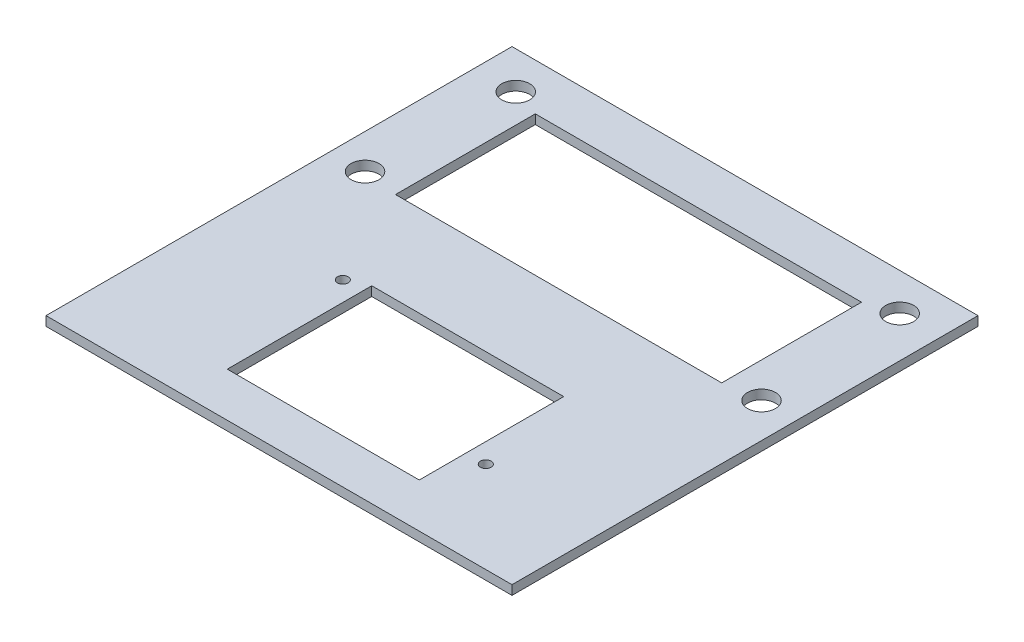
ISO-10303-21;
HEADER;
FILE_DESCRIPTION(('STEP AP214'),'2;1');
FILE_NAME('part.step','',(''),(''),'','','');
FILE_SCHEMA(('AUTOMOTIVE_DESIGN { 1 0 10303 214 1 1 1 1 }'));
ENDSEC;
DATA;
#1=APPLICATION_CONTEXT('core data for automotive mechanical design processes');
#2=APPLICATION_PROTOCOL_DEFINITION('international standard','automotive_design',2000,#1);
#3=PRODUCT_CONTEXT('',#1,'mechanical');
#4=PRODUCT('Part','Part','',(#3));
#5=PRODUCT_RELATED_PRODUCT_CATEGORY('part','',(#4));
#6=PRODUCT_DEFINITION_FORMATION('','',#4);
#7=PRODUCT_DEFINITION_CONTEXT('part definition',#1,'design');
#8=PRODUCT_DEFINITION('design','',#6,#7);
#9=PRODUCT_DEFINITION_SHAPE('','',#8);
#10=(LENGTH_UNIT() NAMED_UNIT(*) SI_UNIT(.MILLI.,.METRE.));
#11=(NAMED_UNIT(*) PLANE_ANGLE_UNIT() SI_UNIT($,.RADIAN.));
#12=(NAMED_UNIT(*) SI_UNIT($,.STERADIAN.) SOLID_ANGLE_UNIT());
#13=UNCERTAINTY_MEASURE_WITH_UNIT(LENGTH_MEASURE(1.E-05),#10,'distance_accuracy_value','');
#14=(GEOMETRIC_REPRESENTATION_CONTEXT(3) GLOBAL_UNCERTAINTY_ASSIGNED_CONTEXT((#13)) GLOBAL_UNIT_ASSIGNED_CONTEXT((#10,
#11,#12)) REPRESENTATION_CONTEXT('',''));
#15=CARTESIAN_POINT('',(0.,0.,0.));
#16=DIRECTION('',(0.,0.,1.));
#17=DIRECTION('',(1.,0.,0.));
#18=AXIS2_PLACEMENT_3D('',#15,#16,#17);
#19=CARTESIAN_POINT('',(0.,1.27,0.));
#20=DIRECTION('',(0.,1.,0.));
#21=DIRECTION('',(0.,0.,1.));
#22=AXIS2_PLACEMENT_3D('',#19,#20,#21);
#23=PLANE('',#22);
#24=CARTESIAN_POINT('',(-15.748,1.27,7.3025));
#25=DIRECTION('',(0.,-1.,0.));
#26=DIRECTION('',(0.,0.,-1.));
#27=AXIS2_PLACEMENT_3D('',#24,#25,#26);
#28=CIRCLE('',#27,0.730249999999999);
#29=CARTESIAN_POINT('',(-15.748,1.27,6.57225));
#30=VERTEX_POINT('',#29);
#31=EDGE_CURVE('E343',#30,#30,#28,.T.);
#32=ORIENTED_EDGE('',*,*,#31,.T.);
#33=EDGE_LOOP('',(#32));
#34=FACE_BOUND('',#33,.T.);
#35=CARTESIAN_POINT('',(15.748,1.27,19.3167));
#36=DIRECTION('',(0.,-1.,0.));
#37=DIRECTION('',(0.,0.,-1.));
#38=AXIS2_PLACEMENT_3D('',#35,#36,#37);
#39=CIRCLE('',#38,0.730250000000003);
#40=CARTESIAN_POINT('',(15.748,1.27,18.58645));
#41=VERTEX_POINT('',#40);
#42=EDGE_CURVE('E348',#41,#41,#39,.T.);
#43=ORIENTED_EDGE('',*,*,#42,.T.);
#44=EDGE_LOOP('',(#43));
#45=FACE_BOUND('',#44,.T.);
#46=DIRECTION('',(0.,0.,1.));
#47=VECTOR('',#46,1.);
#48=CARTESIAN_POINT('',(-13.081,1.27,25.7175));
#49=LINE('',#48,#47);
#50=CARTESIAN_POINT('',(-13.081,1.27,6.0325));
#51=VERTEX_POINT('',#50);
#52=CARTESIAN_POINT('',(-13.081,1.27,25.7175));
#53=VERTEX_POINT('',#52);
#54=EDGE_CURVE('E48',#51,#53,#49,.T.);
#55=ORIENTED_EDGE('',*,*,#54,.F.);
#56=DIRECTION('',(-1.,0.,0.));
#57=VECTOR('',#56,1.);
#58=CARTESIAN_POINT('',(13.081,1.27,6.03249999999999));
#59=LINE('',#58,#57);
#60=CARTESIAN_POINT('',(13.081,1.27,6.03249999999999));
#61=VERTEX_POINT('',#60);
#62=EDGE_CURVE('E130',#61,#51,#59,.T.);
#63=ORIENTED_EDGE('',*,*,#62,.F.);
#64=DIRECTION('',(0.,0.,-1.));
#65=VECTOR('',#64,1.);
#66=CARTESIAN_POINT('',(13.081,1.27,25.7175));
#67=LINE('',#66,#65);
#68=CARTESIAN_POINT('',(13.081,1.27,25.7175));
#69=VERTEX_POINT('',#68);
#70=EDGE_CURVE('E150',#69,#61,#67,.T.);
#71=ORIENTED_EDGE('',*,*,#70,.F.);
#72=DIRECTION('',(1.,0.,0.));
#73=VECTOR('',#72,1.);
#74=CARTESIAN_POINT('',(13.081,1.27,25.7175));
#75=LINE('',#74,#73);
#76=EDGE_CURVE('E144',#53,#69,#75,.T.);
#77=ORIENTED_EDGE('',*,*,#76,.F.);
#78=EDGE_LOOP('',(#55,#63,#71,#77));
#79=FACE_BOUND('',#78,.T.);
#80=DIRECTION('',(0.,0.,1.));
#81=VECTOR('',#80,1.);
#82=CARTESIAN_POINT('',(-22.225,1.27,-6.35));
#83=LINE('',#82,#81);
#84=CARTESIAN_POINT('',(-22.225,1.27,-25.4));
#85=VERTEX_POINT('',#84);
#86=CARTESIAN_POINT('',(-22.225,1.27,-6.35));
#87=VERTEX_POINT('',#86);
#88=EDGE_CURVE('E136',#85,#87,#83,.T.);
#89=ORIENTED_EDGE('',*,*,#88,.F.);
#90=DIRECTION('',(-1.,0.,0.));
#91=VECTOR('',#90,1.);
#92=CARTESIAN_POINT('',(22.225,1.27,-25.4));
#93=LINE('',#92,#91);
#94=CARTESIAN_POINT('',(22.225,1.27,-25.4));
#95=VERTEX_POINT('',#94);
#96=EDGE_CURVE('E163',#95,#85,#93,.T.);
#97=ORIENTED_EDGE('',*,*,#96,.F.);
#98=DIRECTION('',(0.,0.,-1.));
#99=VECTOR('',#98,1.);
#100=CARTESIAN_POINT('',(22.225,1.27,-6.35000000000001));
#101=LINE('',#100,#99);
#102=CARTESIAN_POINT('',(22.225,1.27,-6.35000000000001));
#103=VERTEX_POINT('',#102);
#104=EDGE_CURVE('E177',#103,#95,#101,.T.);
#105=ORIENTED_EDGE('',*,*,#104,.F.);
#106=DIRECTION('',(1.,0.,0.));
#107=VECTOR('',#106,1.);
#108=CARTESIAN_POINT('',(22.225,1.27,-6.35000000000001));
#109=LINE('',#108,#107);
#110=EDGE_CURVE('E174',#87,#103,#109,.T.);
#111=ORIENTED_EDGE('',*,*,#110,.F.);
#112=EDGE_LOOP('',(#89,#97,#105,#111));
#113=FACE_BOUND('',#112,.T.);
#114=CARTESIAN_POINT('',(-26.162,1.27,-26.67));
#115=DIRECTION('',(0.,1.,0.));
#116=DIRECTION('',(0.,0.,1.));
#117=AXIS2_PLACEMENT_3D('',#114,#115,#116);
#118=CIRCLE('',#117,1.905);
#119=CARTESIAN_POINT('',(-26.162,1.27,-24.765));
#120=VERTEX_POINT('',#119);
#121=EDGE_CURVE('E191',#120,#120,#118,.T.);
#122=ORIENTED_EDGE('',*,*,#121,.F.);
#123=EDGE_LOOP('',(#122));
#124=FACE_BOUND('',#123,.T.);
#125=CARTESIAN_POINT('',(-27.0129,1.27,-6.985));
#126=DIRECTION('',(0.,1.,0.));
#127=DIRECTION('',(0.,0.,1.));
#128=AXIS2_PLACEMENT_3D('',#125,#126,#127);
#129=CIRCLE('',#128,1.905);
#130=CARTESIAN_POINT('',(-27.0129,1.27,-5.08));
#131=VERTEX_POINT('',#130);
#132=EDGE_CURVE('E197',#131,#131,#129,.T.);
#133=ORIENTED_EDGE('',*,*,#132,.F.);
#134=EDGE_LOOP('',(#133));
#135=FACE_BOUND('',#134,.T.);
#136=CARTESIAN_POINT('',(27.0129,1.27,-6.98500000000001));
#137=DIRECTION('',(0.,1.,0.));
#138=DIRECTION('',(0.,0.,1.));
#139=AXIS2_PLACEMENT_3D('',#136,#137,#138);
#140=CIRCLE('',#139,1.905);
#141=CARTESIAN_POINT('',(27.0129,1.27,-5.08000000000001));
#142=VERTEX_POINT('',#141);
#143=EDGE_CURVE('E206',#142,#142,#140,.F.);
#144=ORIENTED_EDGE('',*,*,#143,.T.);
#145=EDGE_LOOP('',(#144));
#146=FACE_BOUND('',#145,.T.);
#147=DIRECTION('',(0.,0.,1.));
#148=VECTOR('',#147,1.);
#149=CARTESIAN_POINT('',(-31.75,1.27,31.75));
#150=LINE('',#149,#148);
#151=CARTESIAN_POINT('',(-31.75,1.27,-31.75));
#152=VERTEX_POINT('',#151);
#153=CARTESIAN_POINT('',(-31.75,1.27,31.75));
#154=VERTEX_POINT('',#153);
#155=EDGE_CURVE('E215',#152,#154,#150,.T.);
#156=ORIENTED_EDGE('',*,*,#155,.T.);
#157=DIRECTION('',(1.,0.,0.));
#158=VECTOR('',#157,1.);
#159=CARTESIAN_POINT('',(31.75,1.27,31.75));
#160=LINE('',#159,#158);
#161=CARTESIAN_POINT('',(31.75,1.27,31.75));
#162=VERTEX_POINT('',#161);
#163=EDGE_CURVE('E218',#154,#162,#160,.T.);
#164=ORIENTED_EDGE('',*,*,#163,.T.);
#165=DIRECTION('',(0.,0.,-1.));
#166=VECTOR('',#165,1.);
#167=CARTESIAN_POINT('',(31.75,1.27,31.75));
#168=LINE('',#167,#166);
#169=CARTESIAN_POINT('',(31.75,1.27,-31.75));
#170=VERTEX_POINT('',#169);
#171=EDGE_CURVE('E221',#162,#170,#168,.T.);
#172=ORIENTED_EDGE('',*,*,#171,.T.);
#173=DIRECTION('',(-1.,0.,0.));
#174=VECTOR('',#173,1.);
#175=CARTESIAN_POINT('',(31.75,1.27,-31.75));
#176=LINE('',#175,#174);
#177=EDGE_CURVE('E223',#170,#152,#176,.T.);
#178=ORIENTED_EDGE('',*,*,#177,.T.);
#179=EDGE_LOOP('',(#156,#164,#172,#178));
#180=FACE_BOUND('',#179,.T.);
#181=CARTESIAN_POINT('',(26.162,1.27,-26.67));
#182=DIRECTION('',(0.,1.,0.));
#183=DIRECTION('',(0.,0.,1.));
#184=AXIS2_PLACEMENT_3D('',#181,#182,#183);
#185=CIRCLE('',#184,1.905);
#186=CARTESIAN_POINT('',(26.162,1.27,-24.765));
#187=VERTEX_POINT('',#186);
#188=EDGE_CURVE('E203',#187,#187,#185,.F.);
#189=ORIENTED_EDGE('',*,*,#188,.T.);
#190=EDGE_LOOP('',(#189));
#191=FACE_BOUND('',#190,.T.);
#192=ADVANCED_FACE('F33',(#34,#45,#79,#113,#124,#135,#146,#180,#191),#23,.T.);
#193=CARTESIAN_POINT('',(0.,0.,0.));
#194=DIRECTION('',(0.,1.,0.));
#195=DIRECTION('',(0.,0.,1.));
#196=AXIS2_PLACEMENT_3D('',#193,#194,#195);
#197=PLANE('',#196);
#198=DIRECTION('',(1.,0.,0.));
#199=VECTOR('',#198,1.);
#200=CARTESIAN_POINT('',(13.081,0.,6.03249999999999));
#201=LINE('',#200,#199);
#202=CARTESIAN_POINT('',(-13.081,0.,6.0325));
#203=VERTEX_POINT('',#202);
#204=CARTESIAN_POINT('',(13.081,0.,6.03249999999999));
#205=VERTEX_POINT('',#204);
#206=EDGE_CURVE('E142',#203,#205,#201,.T.);
#207=ORIENTED_EDGE('',*,*,#206,.F.);
#208=DIRECTION('',(0.,0.,-1.));
#209=VECTOR('',#208,1.);
#210=CARTESIAN_POINT('',(-13.081,0.,25.7175));
#211=LINE('',#210,#209);
#212=CARTESIAN_POINT('',(-13.081,0.,25.7175));
#213=VERTEX_POINT('',#212);
#214=EDGE_CURVE('E124',#213,#203,#211,.T.);
#215=ORIENTED_EDGE('',*,*,#214,.F.);
#216=DIRECTION('',(-1.,0.,0.));
#217=VECTOR('',#216,1.);
#218=CARTESIAN_POINT('',(13.081,0.,25.7175));
#219=LINE('',#218,#217);
#220=CARTESIAN_POINT('',(13.081,0.,25.7175));
#221=VERTEX_POINT('',#220);
#222=EDGE_CURVE('E133',#221,#213,#219,.T.);
#223=ORIENTED_EDGE('',*,*,#222,.F.);
#224=DIRECTION('',(0.,0.,1.));
#225=VECTOR('',#224,1.);
#226=CARTESIAN_POINT('',(13.081,0.,25.7175));
#227=LINE('',#226,#225);
#228=EDGE_CURVE('E56',#205,#221,#227,.T.);
#229=ORIENTED_EDGE('',*,*,#228,.F.);
#230=EDGE_LOOP('',(#207,#215,#223,#229));
#231=FACE_BOUND('',#230,.T.);
#232=CARTESIAN_POINT('',(15.748,0.,19.3167));
#233=DIRECTION('',(0.,1.,0.));
#234=DIRECTION('',(0.,0.,1.));
#235=AXIS2_PLACEMENT_3D('',#232,#233,#234);
#236=CIRCLE('',#235,0.730250000000003);
#237=CARTESIAN_POINT('',(15.748,0.,20.04695));
#238=VERTEX_POINT('',#237);
#239=EDGE_CURVE('E351',#238,#238,#236,.T.);
#240=ORIENTED_EDGE('',*,*,#239,.T.);
#241=EDGE_LOOP('',(#240));
#242=FACE_BOUND('',#241,.T.);
#243=CARTESIAN_POINT('',(-15.748,0.,7.3025));
#244=DIRECTION('',(0.,1.,0.));
#245=DIRECTION('',(0.,0.,1.));
#246=AXIS2_PLACEMENT_3D('',#243,#244,#245);
#247=CIRCLE('',#246,0.730249999999999);
#248=CARTESIAN_POINT('',(-15.748,0.,8.03275));
#249=VERTEX_POINT('',#248);
#250=EDGE_CURVE('E346',#249,#249,#247,.T.);
#251=ORIENTED_EDGE('',*,*,#250,.T.);
#252=EDGE_LOOP('',(#251));
#253=FACE_BOUND('',#252,.T.);
#254=DIRECTION('',(-1.,0.,0.));
#255=VECTOR('',#254,1.);
#256=CARTESIAN_POINT('',(22.225,0.,-25.4));
#257=LINE('',#256,#255);
#258=CARTESIAN_POINT('',(22.225,0.,-25.4));
#259=VERTEX_POINT('',#258);
#260=CARTESIAN_POINT('',(-22.225,0.,-25.4));
#261=VERTEX_POINT('',#260);
#262=EDGE_CURVE('E169',#259,#261,#257,.T.);
#263=ORIENTED_EDGE('',*,*,#262,.T.);
#264=DIRECTION('',(0.,0.,1.));
#265=VECTOR('',#264,1.);
#266=CARTESIAN_POINT('',(-22.225,0.,-6.35));
#267=LINE('',#266,#265);
#268=CARTESIAN_POINT('',(-22.225,0.,-6.35));
#269=VERTEX_POINT('',#268);
#270=EDGE_CURVE('E159',#261,#269,#267,.T.);
#271=ORIENTED_EDGE('',*,*,#270,.T.);
#272=DIRECTION('',(1.,0.,0.));
#273=VECTOR('',#272,1.);
#274=CARTESIAN_POINT('',(22.225,0.,-6.35000000000001));
#275=LINE('',#274,#273);
#276=CARTESIAN_POINT('',(22.225,0.,-6.35000000000001));
#277=VERTEX_POINT('',#276);
#278=EDGE_CURVE('E162',#269,#277,#275,.T.);
#279=ORIENTED_EDGE('',*,*,#278,.T.);
#280=DIRECTION('',(0.,0.,-1.));
#281=VECTOR('',#280,1.);
#282=CARTESIAN_POINT('',(22.225,0.,-6.35000000000001));
#283=LINE('',#282,#281);
#284=EDGE_CURVE('E166',#277,#259,#283,.T.);
#285=ORIENTED_EDGE('',*,*,#284,.T.);
#286=EDGE_LOOP('',(#263,#271,#279,#285));
#287=FACE_BOUND('',#286,.T.);
#288=CARTESIAN_POINT('',(-26.162,0.,-26.67));
#289=DIRECTION('',(0.,1.,0.));
#290=DIRECTION('',(0.,0.,1.));
#291=AXIS2_PLACEMENT_3D('',#288,#289,#290);
#292=CIRCLE('',#291,1.905);
#293=CARTESIAN_POINT('',(-26.162,0.,-24.765));
#294=VERTEX_POINT('',#293);
#295=EDGE_CURVE('E184',#294,#294,#292,.T.);
#296=ORIENTED_EDGE('',*,*,#295,.T.);
#297=EDGE_LOOP('',(#296));
#298=FACE_BOUND('',#297,.T.);
#299=CARTESIAN_POINT('',(-27.0129,0.,-6.985));
#300=DIRECTION('',(0.,1.,0.));
#301=DIRECTION('',(0.,0.,1.));
#302=AXIS2_PLACEMENT_3D('',#299,#300,#301);
#303=CIRCLE('',#302,1.905);
#304=CARTESIAN_POINT('',(-27.0129,0.,-5.08));
#305=VERTEX_POINT('',#304);
#306=EDGE_CURVE('E194',#305,#305,#303,.T.);
#307=ORIENTED_EDGE('',*,*,#306,.T.);
#308=EDGE_LOOP('',(#307));
#309=FACE_BOUND('',#308,.T.);
#310=CARTESIAN_POINT('',(27.0129,0.,-6.98500000000001));
#311=DIRECTION('',(0.,1.,0.));
#312=DIRECTION('',(0.,0.,1.));
#313=AXIS2_PLACEMENT_3D('',#310,#311,#312);
#314=CIRCLE('',#313,1.905);
#315=CARTESIAN_POINT('',(27.0129,0.,-5.08000000000001));
#316=VERTEX_POINT('',#315);
#317=EDGE_CURVE('E209',#316,#316,#314,.F.);
#318=ORIENTED_EDGE('',*,*,#317,.F.);
#319=EDGE_LOOP('',(#318));
#320=FACE_BOUND('',#319,.T.);
#321=DIRECTION('',(0.,0.,1.));
#322=VECTOR('',#321,1.);
#323=CARTESIAN_POINT('',(-31.75,0.,31.75));
#324=LINE('',#323,#322);
#325=CARTESIAN_POINT('',(-31.75,0.,-31.75));
#326=VERTEX_POINT('',#325);
#327=CARTESIAN_POINT('',(-31.75,0.,31.75));
#328=VERTEX_POINT('',#327);
#329=EDGE_CURVE('E212',#326,#328,#324,.T.);
#330=ORIENTED_EDGE('',*,*,#329,.F.);
#331=DIRECTION('',(-1.,0.,0.));
#332=VECTOR('',#331,1.);
#333=CARTESIAN_POINT('',(31.75,0.,-31.75));
#334=LINE('',#333,#332);
#335=CARTESIAN_POINT('',(31.75,0.,-31.75));
#336=VERTEX_POINT('',#335);
#337=EDGE_CURVE('E219',#336,#326,#334,.T.);
#338=ORIENTED_EDGE('',*,*,#337,.F.);
#339=DIRECTION('',(0.,0.,-1.));
#340=VECTOR('',#339,1.);
#341=CARTESIAN_POINT('',(31.75,0.,31.75));
#342=LINE('',#341,#340);
#343=CARTESIAN_POINT('',(31.75,0.,31.75));
#344=VERTEX_POINT('',#343);
#345=EDGE_CURVE('E230',#344,#336,#342,.T.);
#346=ORIENTED_EDGE('',*,*,#345,.F.);
#347=DIRECTION('',(1.,0.,0.));
#348=VECTOR('',#347,1.);
#349=CARTESIAN_POINT('',(31.75,0.,31.75));
#350=LINE('',#349,#348);
#351=EDGE_CURVE('E228',#328,#344,#350,.T.);
#352=ORIENTED_EDGE('',*,*,#351,.F.);
#353=EDGE_LOOP('',(#330,#338,#346,#352));
#354=FACE_BOUND('',#353,.T.);
#355=CARTESIAN_POINT('',(26.162,0.,-26.67));
#356=DIRECTION('',(0.,1.,0.));
#357=DIRECTION('',(0.,0.,1.));
#358=AXIS2_PLACEMENT_3D('',#355,#356,#357);
#359=CIRCLE('',#358,1.905);
#360=CARTESIAN_POINT('',(26.162,0.,-24.765));
#361=VERTEX_POINT('',#360);
#362=EDGE_CURVE('E200',#361,#361,#359,.F.);
#363=ORIENTED_EDGE('',*,*,#362,.F.);
#364=EDGE_LOOP('',(#363));
#365=FACE_BOUND('',#364,.T.);
#366=ADVANCED_FACE('F139',(#231,#242,#253,#287,#298,#309,#320,#354,#365),#197,.F.);
#367=CARTESIAN_POINT('',(-31.75,1.27,31.75));
#368=DIRECTION('',(1.,0.,0.));
#369=DIRECTION('',(0.,0.,-1.));
#370=AXIS2_PLACEMENT_3D('',#367,#368,#369);
#371=PLANE('',#370);
#372=ORIENTED_EDGE('',*,*,#329,.T.);
#373=DIRECTION('',(0.,-1.,0.));
#374=VECTOR('',#373,1.);
#375=CARTESIAN_POINT('',(-31.75,1.27,31.75));
#376=LINE('',#375,#374);
#377=EDGE_CURVE('E11',#154,#328,#376,.T.);
#378=ORIENTED_EDGE('',*,*,#377,.F.);
#379=ORIENTED_EDGE('',*,*,#155,.F.);
#380=DIRECTION('',(0.,-1.,0.));
#381=VECTOR('',#380,1.);
#382=CARTESIAN_POINT('',(-31.75,1.27,-31.75));
#383=LINE('',#382,#381);
#384=EDGE_CURVE('E225',#152,#326,#383,.T.);
#385=ORIENTED_EDGE('',*,*,#384,.T.);
#386=EDGE_LOOP('',(#372,#378,#379,#385));
#387=FACE_BOUND('',#386,.T.);
#388=ADVANCED_FACE('F35',(#387),#371,.F.);
#389=CARTESIAN_POINT('',(31.75,1.27,31.75));
#390=DIRECTION('',(0.,0.,-1.));
#391=DIRECTION('',(-1.,0.,0.));
#392=AXIS2_PLACEMENT_3D('',#389,#390,#391);
#393=PLANE('',#392);
#394=ORIENTED_EDGE('',*,*,#351,.T.);
#395=DIRECTION('',(0.,-1.,0.));
#396=VECTOR('',#395,1.);
#397=CARTESIAN_POINT('',(31.75,1.27,31.75));
#398=LINE('',#397,#396);
#399=EDGE_CURVE('E41',#162,#344,#398,.T.);
#400=ORIENTED_EDGE('',*,*,#399,.F.);
#401=ORIENTED_EDGE('',*,*,#163,.F.);
#402=ORIENTED_EDGE('',*,*,#377,.T.);
#403=EDGE_LOOP('',(#394,#400,#401,#402));
#404=FACE_BOUND('',#403,.T.);
#405=ADVANCED_FACE('F258',(#404),#393,.F.);
#406=CARTESIAN_POINT('',(31.75,1.27,31.75));
#407=DIRECTION('',(-1.,0.,0.));
#408=DIRECTION('',(0.,0.,1.));
#409=AXIS2_PLACEMENT_3D('',#406,#407,#408);
#410=PLANE('',#409);
#411=ORIENTED_EDGE('',*,*,#345,.T.);
#412=DIRECTION('',(0.,-1.,0.));
#413=VECTOR('',#412,1.);
#414=CARTESIAN_POINT('',(31.75,1.27,-31.75));
#415=LINE('',#414,#413);
#416=EDGE_CURVE('E235',#170,#336,#415,.T.);
#417=ORIENTED_EDGE('',*,*,#416,.F.);
#418=ORIENTED_EDGE('',*,*,#171,.F.);
#419=ORIENTED_EDGE('',*,*,#399,.T.);
#420=EDGE_LOOP('',(#411,#417,#418,#419));
#421=FACE_BOUND('',#420,.T.);
#422=ADVANCED_FACE('F242',(#421),#410,.F.);
#423=CARTESIAN_POINT('',(31.75,1.27,-31.75));
#424=DIRECTION('',(0.,0.,1.));
#425=DIRECTION('',(1.,0.,0.));
#426=AXIS2_PLACEMENT_3D('',#423,#424,#425);
#427=PLANE('',#426);
#428=ORIENTED_EDGE('',*,*,#337,.T.);
#429=ORIENTED_EDGE('',*,*,#384,.F.);
#430=ORIENTED_EDGE('',*,*,#177,.F.);
#431=ORIENTED_EDGE('',*,*,#416,.T.);
#432=EDGE_LOOP('',(#428,#429,#430,#431));
#433=FACE_BOUND('',#432,.T.);
#434=ADVANCED_FACE('F251',(#433),#427,.F.);
#435=CARTESIAN_POINT('',(27.0129,0.,-6.98500000000001));
#436=DIRECTION('',(0.,1.,0.));
#437=DIRECTION('',(0.,0.,1.));
#438=AXIS2_PLACEMENT_3D('',#435,#436,#437);
#439=CYLINDRICAL_SURFACE('',#438,1.905);
#440=ORIENTED_EDGE('',*,*,#317,.T.);
#441=EDGE_LOOP('',(#440));
#442=FACE_BOUND('',#441,.T.);
#443=ORIENTED_EDGE('',*,*,#143,.F.);
#444=EDGE_LOOP('',(#443));
#445=FACE_BOUND('',#444,.T.);
#446=ADVANCED_FACE('F275',(#442,#445),#439,.F.);
#447=CARTESIAN_POINT('',(26.162,0.,-26.67));
#448=DIRECTION('',(0.,1.,0.));
#449=DIRECTION('',(0.,0.,1.));
#450=AXIS2_PLACEMENT_3D('',#447,#448,#449);
#451=CYLINDRICAL_SURFACE('',#450,1.905);
#452=ORIENTED_EDGE('',*,*,#362,.T.);
#453=EDGE_LOOP('',(#452));
#454=FACE_BOUND('',#453,.T.);
#455=ORIENTED_EDGE('',*,*,#188,.F.);
#456=EDGE_LOOP('',(#455));
#457=FACE_BOUND('',#456,.T.);
#458=ADVANCED_FACE('F282',(#454,#457),#451,.F.);
#459=CARTESIAN_POINT('',(-27.0129,0.,-6.985));
#460=DIRECTION('',(0.,1.,0.));
#461=DIRECTION('',(0.,0.,1.));
#462=AXIS2_PLACEMENT_3D('',#459,#460,#461);
#463=CYLINDRICAL_SURFACE('',#462,1.905);
#464=ORIENTED_EDGE('',*,*,#306,.F.);
#465=EDGE_LOOP('',(#464));
#466=FACE_BOUND('',#465,.T.);
#467=ORIENTED_EDGE('',*,*,#132,.T.);
#468=EDGE_LOOP('',(#467));
#469=FACE_BOUND('',#468,.T.);
#470=ADVANCED_FACE('F287',(#466,#469),#463,.F.);
#471=CARTESIAN_POINT('',(-26.162,0.,-26.67));
#472=DIRECTION('',(0.,1.,0.));
#473=DIRECTION('',(0.,0.,1.));
#474=AXIS2_PLACEMENT_3D('',#471,#472,#473);
#475=CYLINDRICAL_SURFACE('',#474,1.905);
#476=ORIENTED_EDGE('',*,*,#295,.F.);
#477=EDGE_LOOP('',(#476));
#478=FACE_BOUND('',#477,.T.);
#479=ORIENTED_EDGE('',*,*,#121,.T.);
#480=EDGE_LOOP('',(#479));
#481=FACE_BOUND('',#480,.T.);
#482=ADVANCED_FACE('F297',(#478,#481),#475,.F.);
#483=CARTESIAN_POINT('',(-22.225,0.,-6.35));
#484=DIRECTION('',(-1.,0.,0.));
#485=DIRECTION('',(0.,0.,1.));
#486=AXIS2_PLACEMENT_3D('',#483,#484,#485);
#487=PLANE('',#486);
#488=ORIENTED_EDGE('',*,*,#88,.T.);
#489=DIRECTION('',(0.,1.,0.));
#490=VECTOR('',#489,1.);
#491=CARTESIAN_POINT('',(-22.225,0.,-6.35));
#492=LINE('',#491,#490);
#493=EDGE_CURVE('E172',#269,#87,#492,.T.);
#494=ORIENTED_EDGE('',*,*,#493,.F.);
#495=ORIENTED_EDGE('',*,*,#270,.F.);
#496=DIRECTION('',(0.,1.,0.));
#497=VECTOR('',#496,1.);
#498=CARTESIAN_POINT('',(-22.225,0.,-25.4));
#499=LINE('',#498,#497);
#500=EDGE_CURVE('E182',#261,#85,#499,.T.);
#501=ORIENTED_EDGE('',*,*,#500,.T.);
#502=EDGE_LOOP('',(#488,#494,#495,#501));
#503=FACE_BOUND('',#502,.T.);
#504=ADVANCED_FACE('F304',(#503),#487,.F.);
#505=CARTESIAN_POINT('',(22.225,0.,-25.4));
#506=DIRECTION('',(0.,0.,-1.));
#507=DIRECTION('',(-1.,0.,0.));
#508=AXIS2_PLACEMENT_3D('',#505,#506,#507);
#509=PLANE('',#508);
#510=ORIENTED_EDGE('',*,*,#96,.T.);
#511=ORIENTED_EDGE('',*,*,#500,.F.);
#512=ORIENTED_EDGE('',*,*,#262,.F.);
#513=DIRECTION('',(0.,1.,0.));
#514=VECTOR('',#513,1.);
#515=CARTESIAN_POINT('',(22.225,0.,-25.4));
#516=LINE('',#515,#514);
#517=EDGE_CURVE('E185',#259,#95,#516,.T.);
#518=ORIENTED_EDGE('',*,*,#517,.T.);
#519=EDGE_LOOP('',(#510,#511,#512,#518));
#520=FACE_BOUND('',#519,.T.);
#521=ADVANCED_FACE('F308',(#520),#509,.F.);
#522=CARTESIAN_POINT('',(22.225,0.,-6.35000000000001));
#523=DIRECTION('',(1.,0.,0.));
#524=DIRECTION('',(0.,0.,-1.));
#525=AXIS2_PLACEMENT_3D('',#522,#523,#524);
#526=PLANE('',#525);
#527=ORIENTED_EDGE('',*,*,#104,.T.);
#528=ORIENTED_EDGE('',*,*,#517,.F.);
#529=ORIENTED_EDGE('',*,*,#284,.F.);
#530=DIRECTION('',(0.,1.,0.));
#531=VECTOR('',#530,1.);
#532=CARTESIAN_POINT('',(22.225,0.,-6.35000000000001));
#533=LINE('',#532,#531);
#534=EDGE_CURVE('E187',#277,#103,#533,.T.);
#535=ORIENTED_EDGE('',*,*,#534,.T.);
#536=EDGE_LOOP('',(#527,#528,#529,#535));
#537=FACE_BOUND('',#536,.T.);
#538=ADVANCED_FACE('F313',(#537),#526,.F.);
#539=CARTESIAN_POINT('',(22.225,0.,-6.35000000000001));
#540=DIRECTION('',(0.,0.,1.));
#541=DIRECTION('',(1.,0.,0.));
#542=AXIS2_PLACEMENT_3D('',#539,#540,#541);
#543=PLANE('',#542);
#544=ORIENTED_EDGE('',*,*,#110,.T.);
#545=ORIENTED_EDGE('',*,*,#534,.F.);
#546=ORIENTED_EDGE('',*,*,#278,.F.);
#547=ORIENTED_EDGE('',*,*,#493,.T.);
#548=EDGE_LOOP('',(#544,#545,#546,#547));
#549=FACE_BOUND('',#548,.T.);
#550=ADVANCED_FACE('F310',(#549),#543,.F.);
#551=CARTESIAN_POINT('',(-13.081,-2.541,25.7175));
#552=DIRECTION('',(-1.,0.,0.));
#553=DIRECTION('',(0.,0.,1.));
#554=AXIS2_PLACEMENT_3D('',#551,#552,#553);
#555=PLANE('',#554);
#556=ORIENTED_EDGE('',*,*,#214,.T.);
#557=DIRECTION('',(0.,1.,0.));
#558=VECTOR('',#557,1.);
#559=CARTESIAN_POINT('',(-13.081,-2.541,6.0325));
#560=LINE('',#559,#558);
#561=EDGE_CURVE('E137',#203,#51,#560,.T.);
#562=ORIENTED_EDGE('',*,*,#561,.T.);
#563=ORIENTED_EDGE('',*,*,#54,.T.);
#564=DIRECTION('',(0.,1.,0.));
#565=VECTOR('',#564,1.);
#566=CARTESIAN_POINT('',(-13.081,-2.541,25.7175));
#567=LINE('',#566,#565);
#568=EDGE_CURVE('E120',#213,#53,#567,.T.);
#569=ORIENTED_EDGE('',*,*,#568,.F.);
#570=EDGE_LOOP('',(#556,#562,#563,#569));
#571=FACE_BOUND('',#570,.T.);
#572=ADVANCED_FACE('F122',(#571),#555,.F.);
#573=CARTESIAN_POINT('',(13.081,-2.541,6.03249999999999));
#574=DIRECTION('',(0.,0.,-1.));
#575=DIRECTION('',(-1.,0.,0.));
#576=AXIS2_PLACEMENT_3D('',#573,#574,#575);
#577=PLANE('',#576);
#578=ORIENTED_EDGE('',*,*,#206,.T.);
#579=DIRECTION('',(0.,1.,0.));
#580=VECTOR('',#579,1.);
#581=CARTESIAN_POINT('',(13.081,-2.541,6.03249999999999));
#582=LINE('',#581,#580);
#583=EDGE_CURVE('E156',#205,#61,#582,.T.);
#584=ORIENTED_EDGE('',*,*,#583,.T.);
#585=ORIENTED_EDGE('',*,*,#62,.T.);
#586=ORIENTED_EDGE('',*,*,#561,.F.);
#587=EDGE_LOOP('',(#578,#584,#585,#586));
#588=FACE_BOUND('',#587,.T.);
#589=ADVANCED_FACE('F323',(#588),#577,.F.);
#590=CARTESIAN_POINT('',(13.081,-2.541,25.7175));
#591=DIRECTION('',(1.,0.,0.));
#592=DIRECTION('',(0.,0.,-1.));
#593=AXIS2_PLACEMENT_3D('',#590,#591,#592);
#594=PLANE('',#593);
#595=ORIENTED_EDGE('',*,*,#228,.T.);
#596=DIRECTION('',(0.,1.,0.));
#597=VECTOR('',#596,1.);
#598=CARTESIAN_POINT('',(13.081,-2.541,25.7175));
#599=LINE('',#598,#597);
#600=EDGE_CURVE('E129',#221,#69,#599,.T.);
#601=ORIENTED_EDGE('',*,*,#600,.T.);
#602=ORIENTED_EDGE('',*,*,#70,.T.);
#603=ORIENTED_EDGE('',*,*,#583,.F.);
#604=EDGE_LOOP('',(#595,#601,#602,#603));
#605=FACE_BOUND('',#604,.T.);
#606=ADVANCED_FACE('F327',(#605),#594,.F.);
#607=CARTESIAN_POINT('',(13.081,-2.541,25.7175));
#608=DIRECTION('',(0.,0.,1.));
#609=DIRECTION('',(1.,0.,0.));
#610=AXIS2_PLACEMENT_3D('',#607,#608,#609);
#611=PLANE('',#610);
#612=ORIENTED_EDGE('',*,*,#222,.T.);
#613=ORIENTED_EDGE('',*,*,#568,.T.);
#614=ORIENTED_EDGE('',*,*,#76,.T.);
#615=ORIENTED_EDGE('',*,*,#600,.F.);
#616=EDGE_LOOP('',(#612,#613,#614,#615));
#617=FACE_BOUND('',#616,.T.);
#618=ADVANCED_FACE('F134',(#617),#611,.F.);
#619=CARTESIAN_POINT('',(15.748,1.27,19.3167));
#620=DIRECTION('',(0.,-1.,0.));
#621=DIRECTION('',(0.,0.,-1.));
#622=AXIS2_PLACEMENT_3D('',#619,#620,#621);
#623=CYLINDRICAL_SURFACE('',#622,0.730250000000003);
#624=ORIENTED_EDGE('',*,*,#42,.F.);
#625=EDGE_LOOP('',(#624));
#626=FACE_BOUND('',#625,.T.);
#627=ORIENTED_EDGE('',*,*,#239,.F.);
#628=EDGE_LOOP('',(#627));
#629=FACE_BOUND('',#628,.T.);
#630=ADVANCED_FACE('F326',(#626,#629),#623,.F.);
#631=CARTESIAN_POINT('',(-15.748,1.27,7.3025));
#632=DIRECTION('',(0.,-1.,0.));
#633=DIRECTION('',(0.,0.,-1.));
#634=AXIS2_PLACEMENT_3D('',#631,#632,#633);
#635=CYLINDRICAL_SURFACE('',#634,0.730249999999999);
#636=ORIENTED_EDGE('',*,*,#31,.F.);
#637=EDGE_LOOP('',(#636));
#638=FACE_BOUND('',#637,.T.);
#639=ORIENTED_EDGE('',*,*,#250,.F.);
#640=EDGE_LOOP('',(#639));
#641=FACE_BOUND('',#640,.T.);
#642=ADVANCED_FACE('F335',(#638,#641),#635,.F.);
#643=CLOSED_SHELL('',(#192,#366,#388,#405,#422,#434,#446,#458,#470,#482,#504,#521,#538,#550,
#572,#589,#606,#618,#630,#642));
#644=MANIFOLD_SOLID_BREP('B2',#643);
#645=ADVANCED_BREP_SHAPE_REPRESENTATION('',(#18,#644),#14);
#646=SHAPE_DEFINITION_REPRESENTATION(#9,#645);
ENDSEC;
END-ISO-10303-21;
